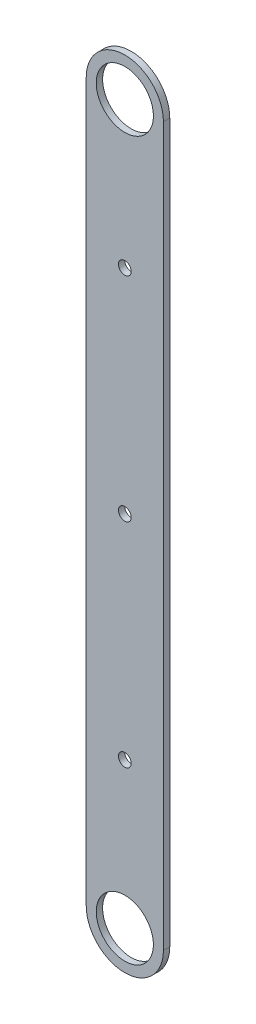
ISO-10303-21;
HEADER;
FILE_DESCRIPTION(('STEP AP214'),'2;1');
FILE_NAME('part.step','',(''),(''),'','','');
FILE_SCHEMA(('AUTOMOTIVE_DESIGN { 1 0 10303 214 1 1 1 1 }'));
ENDSEC;
DATA;
#1=APPLICATION_CONTEXT('core data for automotive mechanical design processes');
#2=APPLICATION_PROTOCOL_DEFINITION('international standard','automotive_design',2000,#1);
#3=PRODUCT_CONTEXT('',#1,'mechanical');
#4=PRODUCT('Part','Part','',(#3));
#5=PRODUCT_RELATED_PRODUCT_CATEGORY('part','',(#4));
#6=PRODUCT_DEFINITION_FORMATION('','',#4);
#7=PRODUCT_DEFINITION_CONTEXT('part definition',#1,'design');
#8=PRODUCT_DEFINITION('design','',#6,#7);
#9=PRODUCT_DEFINITION_SHAPE('','',#8);
#10=(LENGTH_UNIT() NAMED_UNIT(*) SI_UNIT(.MILLI.,.METRE.));
#11=(NAMED_UNIT(*) PLANE_ANGLE_UNIT() SI_UNIT($,.RADIAN.));
#12=(NAMED_UNIT(*) SI_UNIT($,.STERADIAN.) SOLID_ANGLE_UNIT());
#13=UNCERTAINTY_MEASURE_WITH_UNIT(LENGTH_MEASURE(1.E-05),#10,'distance_accuracy_value','');
#14=(GEOMETRIC_REPRESENTATION_CONTEXT(3) GLOBAL_UNCERTAINTY_ASSIGNED_CONTEXT((#13)) GLOBAL_UNIT_ASSIGNED_CONTEXT((#10,
#11,#12)) REPRESENTATION_CONTEXT('',''));
#15=CARTESIAN_POINT('',(0.,0.,0.));
#16=DIRECTION('',(0.,0.,1.));
#17=DIRECTION('',(1.,0.,0.));
#18=AXIS2_PLACEMENT_3D('',#15,#16,#17);
#19=CARTESIAN_POINT('',(0.,179.3875,0.));
#20=DIRECTION('',(0.,0.,1.));
#21=DIRECTION('',(1.,0.,0.));
#22=AXIS2_PLACEMENT_3D('',#19,#20,#21);
#23=PLANE('',#22);
#24=CARTESIAN_POINT('',(0.,0.,0.));
#25=DIRECTION('',(0.,0.,1.));
#26=DIRECTION('',(1.,0.,0.));
#27=AXIS2_PLACEMENT_3D('',#24,#25,#26);
#28=CIRCLE('',#27,14.2875);
#29=CARTESIAN_POINT('',(14.2875,0.,0.));
#30=VERTEX_POINT('',#29);
#31=EDGE_CURVE('E96',#30,#30,#28,.T.);
#32=ORIENTED_EDGE('',*,*,#31,.T.);
#33=EDGE_LOOP('',(#32));
#34=FACE_BOUND('',#33,.T.);
#35=CARTESIAN_POINT('',(0.,358.775,0.));
#36=DIRECTION('',(0.,0.,1.));
#37=DIRECTION('',(1.,0.,0.));
#38=AXIS2_PLACEMENT_3D('',#35,#36,#37);
#39=CIRCLE('',#38,14.2875);
#40=CARTESIAN_POINT('',(14.2875,358.775,0.));
#41=VERTEX_POINT('',#40);
#42=EDGE_CURVE('E99',#41,#41,#39,.T.);
#43=ORIENTED_EDGE('',*,*,#42,.T.);
#44=EDGE_LOOP('',(#43));
#45=FACE_BOUND('',#44,.T.);
#46=CARTESIAN_POINT('',(0.,72.90625,0.));
#47=DIRECTION('',(0.,0.,1.));
#48=DIRECTION('',(1.,0.,0.));
#49=AXIS2_PLACEMENT_3D('',#46,#47,#48);
#50=CIRCLE('',#49,3.175);
#51=CARTESIAN_POINT('',(3.175,72.90625,0.));
#52=VERTEX_POINT('',#51);
#53=EDGE_CURVE('E102',#52,#52,#50,.T.);
#54=ORIENTED_EDGE('',*,*,#53,.T.);
#55=EDGE_LOOP('',(#54));
#56=FACE_BOUND('',#55,.T.);
#57=CARTESIAN_POINT('',(0.,285.86875,0.));
#58=DIRECTION('',(0.,0.,1.));
#59=DIRECTION('',(1.,0.,0.));
#60=AXIS2_PLACEMENT_3D('',#57,#58,#59);
#61=CIRCLE('',#60,3.17499999999999);
#62=CARTESIAN_POINT('',(3.17499999999999,285.86875,0.));
#63=VERTEX_POINT('',#62);
#64=EDGE_CURVE('E105',#63,#63,#61,.T.);
#65=ORIENTED_EDGE('',*,*,#64,.T.);
#66=EDGE_LOOP('',(#65));
#67=FACE_BOUND('',#66,.T.);
#68=CARTESIAN_POINT('',(0.,179.3875,0.));
#69=DIRECTION('',(0.,0.,1.));
#70=DIRECTION('',(1.,0.,0.));
#71=AXIS2_PLACEMENT_3D('',#68,#69,#70);
#72=CIRCLE('',#71,3.17499999999999);
#73=CARTESIAN_POINT('',(3.17499999999999,179.3875,0.));
#74=VERTEX_POINT('',#73);
#75=EDGE_CURVE('E108',#74,#74,#72,.T.);
#76=ORIENTED_EDGE('',*,*,#75,.T.);
#77=EDGE_LOOP('',(#76));
#78=FACE_BOUND('',#77,.T.);
#79=DIRECTION('',(0.,1.,0.));
#80=VECTOR('',#79,1.);
#81=CARTESIAN_POINT('',(-19.2875,358.775,0.));
#82=LINE('',#81,#80);
#83=CARTESIAN_POINT('',(-19.2875,358.775,0.));
#84=VERTEX_POINT('',#83);
#85=CARTESIAN_POINT('',(-19.2875,0.,0.));
#86=VERTEX_POINT('',#85);
#87=EDGE_CURVE('E56',#84,#86,#82,.F.);
#88=ORIENTED_EDGE('',*,*,#87,.F.);
#89=CARTESIAN_POINT('',(0.,358.775,0.));
#90=DIRECTION('',(0.,0.,1.));
#91=DIRECTION('',(1.,0.,0.));
#92=AXIS2_PLACEMENT_3D('',#89,#90,#91);
#93=CIRCLE('',#92,19.2875);
#94=CARTESIAN_POINT('',(19.2875,358.775,0.));
#95=VERTEX_POINT('',#94);
#96=EDGE_CURVE('E73',#95,#84,#93,.T.);
#97=ORIENTED_EDGE('',*,*,#96,.F.);
#98=DIRECTION('',(0.,1.,0.));
#99=VECTOR('',#98,1.);
#100=CARTESIAN_POINT('',(19.2875,0.,0.));
#101=LINE('',#100,#99);
#102=CARTESIAN_POINT('',(19.2875,0.,0.));
#103=VERTEX_POINT('',#102);
#104=EDGE_CURVE('E58',#103,#95,#101,.T.);
#105=ORIENTED_EDGE('',*,*,#104,.F.);
#106=CARTESIAN_POINT('',(0.,0.,0.));
#107=DIRECTION('',(0.,0.,1.));
#108=DIRECTION('',(1.,0.,0.));
#109=AXIS2_PLACEMENT_3D('',#106,#107,#108);
#110=CIRCLE('',#109,19.2875);
#111=EDGE_CURVE('E18',#86,#103,#110,.T.);
#112=ORIENTED_EDGE('',*,*,#111,.F.);
#113=EDGE_LOOP('',(#88,#97,#105,#112));
#114=FACE_BOUND('',#113,.T.);
#115=ADVANCED_FACE('F15',(#34,#45,#56,#67,#78,#114),#23,.F.);
#116=CARTESIAN_POINT('',(0.,0.,0.));
#117=DIRECTION('',(0.,0.,1.));
#118=DIRECTION('',(1.,0.,0.));
#119=AXIS2_PLACEMENT_3D('',#116,#117,#118);
#120=CYLINDRICAL_SURFACE('',#119,19.2875);
#121=CARTESIAN_POINT('',(0.,0.,3.175));
#122=DIRECTION('',(0.,0.,1.));
#123=DIRECTION('',(1.,0.,0.));
#124=AXIS2_PLACEMENT_3D('',#121,#122,#123);
#125=CIRCLE('',#124,19.2875);
#126=CARTESIAN_POINT('',(-19.2875,0.,3.175));
#127=VERTEX_POINT('',#126);
#128=CARTESIAN_POINT('',(19.2875,0.,3.175));
#129=VERTEX_POINT('',#128);
#130=EDGE_CURVE('E65',#127,#129,#125,.T.);
#131=ORIENTED_EDGE('',*,*,#130,.F.);
#132=DIRECTION('',(0.,0.,1.));
#133=VECTOR('',#132,1.);
#134=CARTESIAN_POINT('',(-19.2875,0.,0.));
#135=LINE('',#134,#133);
#136=EDGE_CURVE('E62',#86,#127,#135,.T.);
#137=ORIENTED_EDGE('',*,*,#136,.F.);
#138=ORIENTED_EDGE('',*,*,#111,.T.);
#139=DIRECTION('',(0.,0.,1.));
#140=VECTOR('',#139,1.);
#141=CARTESIAN_POINT('',(19.2875,0.,0.));
#142=LINE('',#141,#140);
#143=EDGE_CURVE('E77',#129,#103,#142,.F.);
#144=ORIENTED_EDGE('',*,*,#143,.F.);
#145=EDGE_LOOP('',(#131,#137,#138,#144));
#146=FACE_BOUND('',#145,.T.);
#147=ADVANCED_FACE('F63',(#146),#120,.T.);
#148=CARTESIAN_POINT('',(19.2875,0.,0.));
#149=DIRECTION('',(1.,0.,0.));
#150=DIRECTION('',(0.,1.,0.));
#151=AXIS2_PLACEMENT_3D('',#148,#149,#150);
#152=PLANE('',#151);
#153=DIRECTION('',(0.,1.,0.));
#154=VECTOR('',#153,1.);
#155=CARTESIAN_POINT('',(19.2875,179.3875,3.175));
#156=LINE('',#155,#154);
#157=CARTESIAN_POINT('',(19.2875,358.775,3.175));
#158=VERTEX_POINT('',#157);
#159=EDGE_CURVE('E94',#129,#158,#156,.T.);
#160=ORIENTED_EDGE('',*,*,#159,.F.);
#161=ORIENTED_EDGE('',*,*,#143,.T.);
#162=ORIENTED_EDGE('',*,*,#104,.T.);
#163=DIRECTION('',(0.,0.,1.));
#164=VECTOR('',#163,1.);
#165=CARTESIAN_POINT('',(19.2875,358.775,0.));
#166=LINE('',#165,#164);
#167=EDGE_CURVE('E70',#158,#95,#166,.F.);
#168=ORIENTED_EDGE('',*,*,#167,.F.);
#169=EDGE_LOOP('',(#160,#161,#162,#168));
#170=FACE_BOUND('',#169,.T.);
#171=ADVANCED_FACE('F112',(#170),#152,.T.);
#172=CARTESIAN_POINT('',(0.,358.775,0.));
#173=DIRECTION('',(0.,0.,1.));
#174=DIRECTION('',(1.,0.,0.));
#175=AXIS2_PLACEMENT_3D('',#172,#173,#174);
#176=CYLINDRICAL_SURFACE('',#175,19.2875);
#177=CARTESIAN_POINT('',(0.,358.775,3.175));
#178=DIRECTION('',(0.,0.,1.));
#179=DIRECTION('',(1.,0.,0.));
#180=AXIS2_PLACEMENT_3D('',#177,#178,#179);
#181=CIRCLE('',#180,19.2875);
#182=CARTESIAN_POINT('',(-19.2875,358.775,3.175));
#183=VERTEX_POINT('',#182);
#184=EDGE_CURVE('E91',#158,#183,#181,.T.);
#185=ORIENTED_EDGE('',*,*,#184,.F.);
#186=ORIENTED_EDGE('',*,*,#167,.T.);
#187=ORIENTED_EDGE('',*,*,#96,.T.);
#188=DIRECTION('',(0.,0.,1.));
#189=VECTOR('',#188,1.);
#190=CARTESIAN_POINT('',(-19.2875,358.775,0.));
#191=LINE('',#190,#189);
#192=EDGE_CURVE('E33',#183,#84,#191,.F.);
#193=ORIENTED_EDGE('',*,*,#192,.F.);
#194=EDGE_LOOP('',(#185,#186,#187,#193));
#195=FACE_BOUND('',#194,.T.);
#196=ADVANCED_FACE('F119',(#195),#176,.T.);
#197=CARTESIAN_POINT('',(-19.2875,358.775,0.));
#198=DIRECTION('',(-1.,0.,0.));
#199=DIRECTION('',(0.,0.,1.));
#200=AXIS2_PLACEMENT_3D('',#197,#198,#199);
#201=PLANE('',#200);
#202=DIRECTION('',(0.,1.,0.));
#203=VECTOR('',#202,1.);
#204=CARTESIAN_POINT('',(-19.2875,179.3875,3.175));
#205=LINE('',#204,#203);
#206=EDGE_CURVE('E90',#183,#127,#205,.F.);
#207=ORIENTED_EDGE('',*,*,#206,.F.);
#208=ORIENTED_EDGE('',*,*,#192,.T.);
#209=ORIENTED_EDGE('',*,*,#87,.T.);
#210=ORIENTED_EDGE('',*,*,#136,.T.);
#211=EDGE_LOOP('',(#207,#208,#209,#210));
#212=FACE_BOUND('',#211,.T.);
#213=ADVANCED_FACE('F69',(#212),#201,.T.);
#214=CARTESIAN_POINT('',(0.,179.3875,0.));
#215=DIRECTION('',(0.,0.,1.));
#216=DIRECTION('',(1.,0.,0.));
#217=AXIS2_PLACEMENT_3D('',#214,#215,#216);
#218=CYLINDRICAL_SURFACE('',#217,3.17499999999999);
#219=ORIENTED_EDGE('',*,*,#75,.F.);
#220=EDGE_LOOP('',(#219));
#221=FACE_BOUND('',#220,.T.);
#222=CARTESIAN_POINT('',(0.,179.3875,3.175));
#223=DIRECTION('',(0.,0.,1.));
#224=DIRECTION('',(1.,0.,0.));
#225=AXIS2_PLACEMENT_3D('',#222,#223,#224);
#226=CIRCLE('',#225,3.17499999999999);
#227=CARTESIAN_POINT('',(3.17499999999999,179.3875,3.175));
#228=VERTEX_POINT('',#227);
#229=EDGE_CURVE('E87',#228,#228,#226,.F.);
#230=ORIENTED_EDGE('',*,*,#229,.F.);
#231=EDGE_LOOP('',(#230));
#232=FACE_BOUND('',#231,.T.);
#233=ADVANCED_FACE('F127',(#221,#232),#218,.F.);
#234=CARTESIAN_POINT('',(0.,285.86875,0.));
#235=DIRECTION('',(0.,0.,1.));
#236=DIRECTION('',(1.,0.,0.));
#237=AXIS2_PLACEMENT_3D('',#234,#235,#236);
#238=CYLINDRICAL_SURFACE('',#237,3.17499999999999);
#239=ORIENTED_EDGE('',*,*,#64,.F.);
#240=EDGE_LOOP('',(#239));
#241=FACE_BOUND('',#240,.T.);
#242=CARTESIAN_POINT('',(0.,285.86875,3.175));
#243=DIRECTION('',(0.,0.,1.));
#244=DIRECTION('',(1.,0.,0.));
#245=AXIS2_PLACEMENT_3D('',#242,#243,#244);
#246=CIRCLE('',#245,3.17499999999999);
#247=CARTESIAN_POINT('',(3.17499999999999,285.86875,3.175));
#248=VERTEX_POINT('',#247);
#249=EDGE_CURVE('E84',#248,#248,#246,.F.);
#250=ORIENTED_EDGE('',*,*,#249,.F.);
#251=EDGE_LOOP('',(#250));
#252=FACE_BOUND('',#251,.T.);
#253=ADVANCED_FACE('F148',(#241,#252),#238,.F.);
#254=CARTESIAN_POINT('',(0.,72.90625,0.));
#255=DIRECTION('',(0.,0.,1.));
#256=DIRECTION('',(1.,0.,0.));
#257=AXIS2_PLACEMENT_3D('',#254,#255,#256);
#258=CYLINDRICAL_SURFACE('',#257,3.175);
#259=ORIENTED_EDGE('',*,*,#53,.F.);
#260=EDGE_LOOP('',(#259));
#261=FACE_BOUND('',#260,.T.);
#262=CARTESIAN_POINT('',(0.,72.90625,3.175));
#263=DIRECTION('',(0.,0.,1.));
#264=DIRECTION('',(1.,0.,0.));
#265=AXIS2_PLACEMENT_3D('',#262,#263,#264);
#266=CIRCLE('',#265,3.175);
#267=CARTESIAN_POINT('',(3.175,72.90625,3.175));
#268=VERTEX_POINT('',#267);
#269=EDGE_CURVE('E81',#268,#268,#266,.F.);
#270=ORIENTED_EDGE('',*,*,#269,.F.);
#271=EDGE_LOOP('',(#270));
#272=FACE_BOUND('',#271,.T.);
#273=ADVANCED_FACE('F144',(#261,#272),#258,.F.);
#274=CARTESIAN_POINT('',(0.,358.775,0.));
#275=DIRECTION('',(0.,0.,1.));
#276=DIRECTION('',(1.,0.,0.));
#277=AXIS2_PLACEMENT_3D('',#274,#275,#276);
#278=CYLINDRICAL_SURFACE('',#277,14.2875);
#279=ORIENTED_EDGE('',*,*,#42,.F.);
#280=EDGE_LOOP('',(#279));
#281=FACE_BOUND('',#280,.T.);
#282=CARTESIAN_POINT('',(0.,358.775,3.175));
#283=DIRECTION('',(0.,0.,1.));
#284=DIRECTION('',(1.,0.,0.));
#285=AXIS2_PLACEMENT_3D('',#282,#283,#284);
#286=CIRCLE('',#285,14.2875);
#287=CARTESIAN_POINT('',(14.2875,358.775,3.175));
#288=VERTEX_POINT('',#287);
#289=EDGE_CURVE('E24',#288,#288,#286,.F.);
#290=ORIENTED_EDGE('',*,*,#289,.F.);
#291=EDGE_LOOP('',(#290));
#292=FACE_BOUND('',#291,.T.);
#293=ADVANCED_FACE('F137',(#281,#292),#278,.F.);
#294=CARTESIAN_POINT('',(0.,0.,0.));
#295=DIRECTION('',(0.,0.,1.));
#296=DIRECTION('',(1.,0.,0.));
#297=AXIS2_PLACEMENT_3D('',#294,#295,#296);
#298=CYLINDRICAL_SURFACE('',#297,14.2875);
#299=ORIENTED_EDGE('',*,*,#31,.F.);
#300=EDGE_LOOP('',(#299));
#301=FACE_BOUND('',#300,.T.);
#302=CARTESIAN_POINT('',(0.,0.,3.175));
#303=DIRECTION('',(0.,0.,1.));
#304=DIRECTION('',(1.,0.,0.));
#305=AXIS2_PLACEMENT_3D('',#302,#303,#304);
#306=CIRCLE('',#305,14.2875);
#307=CARTESIAN_POINT('',(14.2875,0.,3.175));
#308=VERTEX_POINT('',#307);
#309=EDGE_CURVE('E10',#308,#308,#306,.F.);
#310=ORIENTED_EDGE('',*,*,#309,.F.);
#311=EDGE_LOOP('',(#310));
#312=FACE_BOUND('',#311,.T.);
#313=ADVANCED_FACE('F131',(#301,#312),#298,.F.);
#314=CARTESIAN_POINT('',(0.,179.3875,3.175));
#315=DIRECTION('',(0.,0.,1.));
#316=DIRECTION('',(1.,0.,0.));
#317=AXIS2_PLACEMENT_3D('',#314,#315,#316);
#318=PLANE('',#317);
#319=ORIENTED_EDGE('',*,*,#309,.T.);
#320=EDGE_LOOP('',(#319));
#321=FACE_BOUND('',#320,.T.);
#322=ORIENTED_EDGE('',*,*,#289,.T.);
#323=EDGE_LOOP('',(#322));
#324=FACE_BOUND('',#323,.T.);
#325=ORIENTED_EDGE('',*,*,#269,.T.);
#326=EDGE_LOOP('',(#325));
#327=FACE_BOUND('',#326,.T.);
#328=ORIENTED_EDGE('',*,*,#249,.T.);
#329=EDGE_LOOP('',(#328));
#330=FACE_BOUND('',#329,.T.);
#331=ORIENTED_EDGE('',*,*,#229,.T.);
#332=EDGE_LOOP('',(#331));
#333=FACE_BOUND('',#332,.T.);
#334=ORIENTED_EDGE('',*,*,#184,.T.);
#335=ORIENTED_EDGE('',*,*,#206,.T.);
#336=ORIENTED_EDGE('',*,*,#130,.T.);
#337=ORIENTED_EDGE('',*,*,#159,.T.);
#338=EDGE_LOOP('',(#334,#335,#336,#337));
#339=FACE_BOUND('',#338,.T.);
#340=ADVANCED_FACE('F116',(#321,#324,#327,#330,#333,#339),#318,.T.);
#341=CLOSED_SHELL('',(#115,#147,#171,#196,#213,#233,#253,#273,#293,#313,#340));
#342=MANIFOLD_SOLID_BREP('B1',#341);
#343=ADVANCED_BREP_SHAPE_REPRESENTATION('',(#18,#342),#14);
#344=SHAPE_DEFINITION_REPRESENTATION(#9,#343);
ENDSEC;
END-ISO-10303-21;
